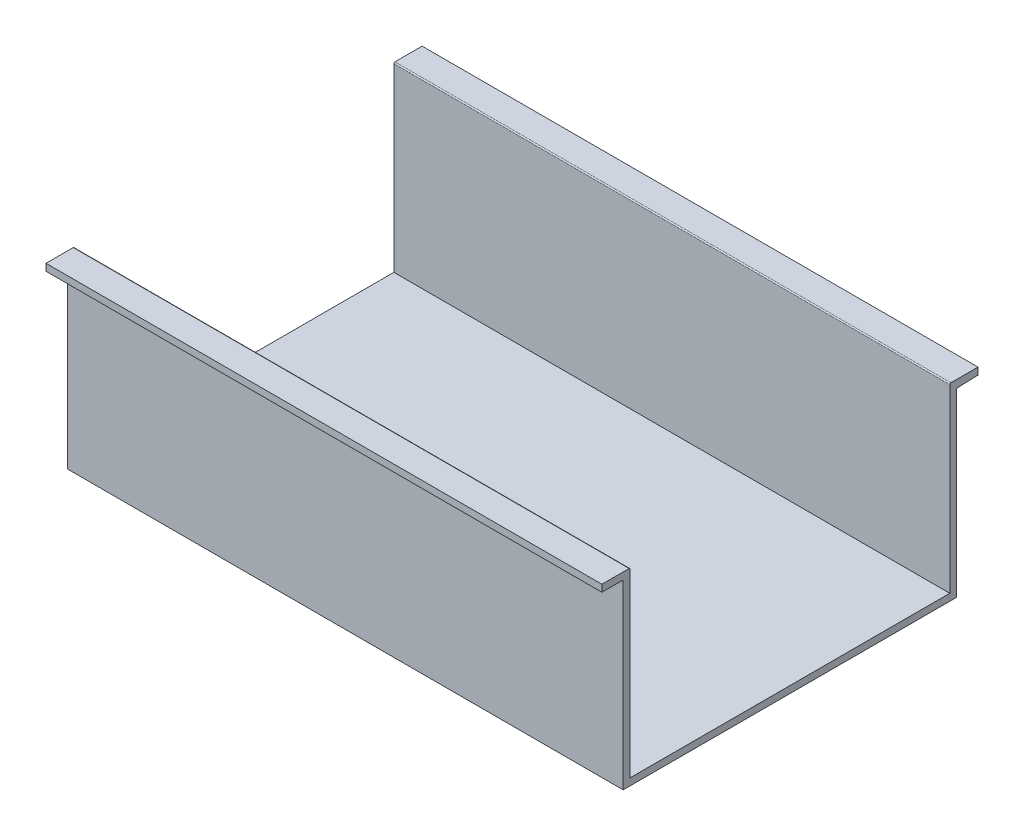
ISO-10303-21;
HEADER;
FILE_DESCRIPTION(('STEP AP214'),'2;1');
FILE_NAME('part.step','',(''),(''),'','','');
FILE_SCHEMA(('AUTOMOTIVE_DESIGN { 1 0 10303 214 1 1 1 1 }'));
ENDSEC;
DATA;
#1=APPLICATION_CONTEXT('core data for automotive mechanical design processes');
#2=APPLICATION_PROTOCOL_DEFINITION('international standard','automotive_design',2000,#1);
#3=PRODUCT_CONTEXT('',#1,'mechanical');
#4=PRODUCT('Part','Part','',(#3));
#5=PRODUCT_RELATED_PRODUCT_CATEGORY('part','',(#4));
#6=PRODUCT_DEFINITION_FORMATION('','',#4);
#7=PRODUCT_DEFINITION_CONTEXT('part definition',#1,'design');
#8=PRODUCT_DEFINITION('design','',#6,#7);
#9=PRODUCT_DEFINITION_SHAPE('','',#8);
#10=(LENGTH_UNIT() NAMED_UNIT(*) SI_UNIT(.MILLI.,.METRE.));
#11=(NAMED_UNIT(*) PLANE_ANGLE_UNIT() SI_UNIT($,.RADIAN.));
#12=(NAMED_UNIT(*) SI_UNIT($,.STERADIAN.) SOLID_ANGLE_UNIT());
#13=UNCERTAINTY_MEASURE_WITH_UNIT(LENGTH_MEASURE(1.E-05),#10,'distance_accuracy_value','');
#14=(GEOMETRIC_REPRESENTATION_CONTEXT(3) GLOBAL_UNCERTAINTY_ASSIGNED_CONTEXT((#13)) GLOBAL_UNIT_ASSIGNED_CONTEXT((#10,
#11,#12)) REPRESENTATION_CONTEXT('',''));
#15=CARTESIAN_POINT('',(0.,0.,0.));
#16=DIRECTION('',(0.,0.,1.));
#17=DIRECTION('',(1.,0.,0.));
#18=AXIS2_PLACEMENT_3D('',#15,#16,#17);
#19=CARTESIAN_POINT('',(400.,-0.8,-240.));
#20=DIRECTION('',(0.,0.,1.));
#21=DIRECTION('',(0.,-1.,0.));
#22=AXIS2_PLACEMENT_3D('',#19,#20,#21);
#23=PLANE('',#22);
#24=DIRECTION('',(0.,1.,0.));
#25=VECTOR('',#24,1.);
#26=CARTESIAN_POINT('',(0.,-0.8,-240.));
#27=LINE('',#26,#25);
#28=CARTESIAN_POINT('',(0.,-130.270799085378,-240.));
#29=VERTEX_POINT('',#28);
#30=CARTESIAN_POINT('',(0.,-0.8,-240.));
#31=VERTEX_POINT('',#30);
#32=EDGE_CURVE('E190',#29,#31,#27,.T.);
#33=ORIENTED_EDGE('',*,*,#32,.T.);
#34=DIRECTION('',(-1.,0.,0.));
#35=VECTOR('',#34,1.);
#36=CARTESIAN_POINT('',(400.,-0.8,-240.));
#37=LINE('',#36,#35);
#38=CARTESIAN_POINT('',(400.,-0.8,-240.));
#39=VERTEX_POINT('',#38);
#40=EDGE_CURVE('E11',#39,#31,#37,.T.);
#41=ORIENTED_EDGE('',*,*,#40,.F.);
#42=DIRECTION('',(0.,1.,0.));
#43=VECTOR('',#42,1.);
#44=CARTESIAN_POINT('',(400.,-0.8,-240.));
#45=LINE('',#44,#43);
#46=CARTESIAN_POINT('',(400.,-130.270799085378,-240.));
#47=VERTEX_POINT('',#46);
#48=EDGE_CURVE('E238',#47,#39,#45,.T.);
#49=ORIENTED_EDGE('',*,*,#48,.F.);
#50=DIRECTION('',(-1.,0.,0.));
#51=VECTOR('',#50,1.);
#52=CARTESIAN_POINT('',(400.,-130.270799085378,-240.));
#53=LINE('',#52,#51);
#54=EDGE_CURVE('E186',#47,#29,#53,.T.);
#55=ORIENTED_EDGE('',*,*,#54,.T.);
#56=EDGE_LOOP('',(#33,#41,#49,#55));
#57=FACE_BOUND('',#56,.T.);
#58=ADVANCED_FACE('F41',(#57),#23,.F.);
#59=CARTESIAN_POINT('',(400.,-0.8,-240.8));
#60=DIRECTION('',(-1.,0.,0.));
#61=DIRECTION('',(0.,0.,1.));
#62=AXIS2_PLACEMENT_3D('',#59,#60,#61);
#63=CYLINDRICAL_SURFACE('',#62,0.799999999999997);
#64=CARTESIAN_POINT('',(0.,-0.8,-240.8));
#65=DIRECTION('',(-1.,0.,0.));
#66=DIRECTION('',(0.,0.,-1.));
#67=AXIS2_PLACEMENT_3D('',#64,#65,#66);
#68=CIRCLE('',#67,0.799999999999997);
#69=CARTESIAN_POINT('',(0.,-0.000530043772431423,-240.770883182016));
#70=VERTEX_POINT('',#69);
#71=EDGE_CURVE('E194',#31,#70,#68,.T.);
#72=ORIENTED_EDGE('',*,*,#71,.T.);
#73=DIRECTION('',(-1.,0.,0.));
#74=VECTOR('',#73,1.);
#75=CARTESIAN_POINT('',(400.,-0.000530043772431423,-240.770883182016));
#76=LINE('',#75,#74);
#77=CARTESIAN_POINT('',(400.,-0.000530043772431423,-240.770883182016));
#78=VERTEX_POINT('',#77);
#79=EDGE_CURVE('E50',#78,#70,#76,.T.);
#80=ORIENTED_EDGE('',*,*,#79,.F.);
#81=CARTESIAN_POINT('',(400.,-0.8,-240.8));
#82=DIRECTION('',(-1.,0.,0.));
#83=DIRECTION('',(0.,0.,-1.));
#84=AXIS2_PLACEMENT_3D('',#81,#82,#83);
#85=CIRCLE('',#84,0.799999999999997);
#86=EDGE_CURVE('E125',#39,#78,#85,.T.);
#87=ORIENTED_EDGE('',*,*,#86,.F.);
#88=ORIENTED_EDGE('',*,*,#40,.T.);
#89=EDGE_LOOP('',(#72,#80,#87,#88));
#90=FACE_BOUND('',#89,.T.);
#91=ADVANCED_FACE('F360',(#90),#63,.F.);
#92=CARTESIAN_POINT('',(400.,-0.000530043772431423,-240.770883182016));
#93=DIRECTION('',(0.,0.99933744528446,0.0363960224795136));
#94=DIRECTION('',(0.,-0.0363960224795136,0.99933744528446));
#95=AXIS2_PLACEMENT_3D('',#92,#93,#94);
#96=PLANE('',#95);
#97=DIRECTION('',(0.,0.0363960224795136,-0.99933744528446));
#98=VECTOR('',#97,1.);
#99=CARTESIAN_POINT('',(0.,-0.000530043772431423,-240.770883182016));
#100=LINE('',#99,#98);
#101=CARTESIAN_POINT('',(0.,0.529200914621561,-255.315878667375));
#102=VERTEX_POINT('',#101);
#103=EDGE_CURVE('E197',#70,#102,#100,.T.);
#104=ORIENTED_EDGE('',*,*,#103,.T.);
#105=DIRECTION('',(-1.,0.,0.));
#106=VECTOR('',#105,1.);
#107=CARTESIAN_POINT('',(400.,0.529200914621561,-255.315878667375));
#108=LINE('',#107,#106);
#109=CARTESIAN_POINT('',(400.,0.529200914621561,-255.315878667375));
#110=VERTEX_POINT('',#109);
#111=EDGE_CURVE('E281',#110,#102,#108,.T.);
#112=ORIENTED_EDGE('',*,*,#111,.F.);
#113=DIRECTION('',(0.,0.0363960224795136,-0.99933744528446));
#114=VECTOR('',#113,1.);
#115=CARTESIAN_POINT('',(400.,-0.000530043772431423,-240.770883182016));
#116=LINE('',#115,#114);
#117=EDGE_CURVE('E291',#78,#110,#116,.T.);
#118=ORIENTED_EDGE('',*,*,#117,.F.);
#119=ORIENTED_EDGE('',*,*,#79,.T.);
#120=EDGE_LOOP('',(#104,#112,#118,#119));
#121=FACE_BOUND('',#120,.T.);
#122=ADVANCED_FACE('F289',(#121),#96,.F.);
#123=CARTESIAN_POINT('',(400.,0.529200914621561,-255.315878667375));
#124=DIRECTION('',(0.,0.,1.));
#125=DIRECTION('',(1.,0.,0.));
#126=AXIS2_PLACEMENT_3D('',#123,#124,#125);
#127=PLANE('',#126);
#128=DIRECTION('',(0.,1.,0.));
#129=VECTOR('',#128,1.);
#130=CARTESIAN_POINT('',(0.,0.529200914621561,-255.315878667375));
#131=LINE('',#130,#129);
#132=CARTESIAN_POINT('',(0.,5.52920091462156,-255.315878667375));
#133=VERTEX_POINT('',#132);
#134=EDGE_CURVE('E200',#102,#133,#131,.T.);
#135=ORIENTED_EDGE('',*,*,#134,.T.);
#136=DIRECTION('',(-1.,0.,0.));
#137=VECTOR('',#136,1.);
#138=CARTESIAN_POINT('',(400.,5.52920091462156,-255.315878667375));
#139=LINE('',#138,#137);
#140=CARTESIAN_POINT('',(400.,5.52920091462156,-255.315878667375));
#141=VERTEX_POINT('',#140);
#142=EDGE_CURVE('E277',#141,#133,#139,.T.);
#143=ORIENTED_EDGE('',*,*,#142,.F.);
#144=DIRECTION('',(0.,1.,0.));
#145=VECTOR('',#144,1.);
#146=CARTESIAN_POINT('',(400.,0.529200914621561,-255.315878667375));
#147=LINE('',#146,#145);
#148=EDGE_CURVE('E310',#110,#141,#147,.T.);
#149=ORIENTED_EDGE('',*,*,#148,.F.);
#150=ORIENTED_EDGE('',*,*,#111,.T.);
#151=EDGE_LOOP('',(#135,#143,#149,#150));
#152=FACE_BOUND('',#151,.T.);
#153=ADVANCED_FACE('F300',(#152),#127,.F.);
#154=CARTESIAN_POINT('',(400.,5.52920091462156,-255.315878667375));
#155=DIRECTION('',(0.,-1.,0.));
#156=DIRECTION('',(0.,0.,-1.));
#157=AXIS2_PLACEMENT_3D('',#154,#155,#156);
#158=PLANE('',#157);
#159=DIRECTION('',(0.,0.,1.));
#160=VECTOR('',#159,1.);
#161=CARTESIAN_POINT('',(0.,5.52920091462156,-255.315878667375));
#162=LINE('',#161,#160);
#163=CARTESIAN_POINT('',(0.,5.52920091462156,-235.8));
#164=VERTEX_POINT('',#163);
#165=EDGE_CURVE('E203',#133,#164,#162,.T.);
#166=ORIENTED_EDGE('',*,*,#165,.T.);
#167=DIRECTION('',(-1.,0.,0.));
#168=VECTOR('',#167,1.);
#169=CARTESIAN_POINT('',(400.,5.52920091462156,-235.8));
#170=LINE('',#169,#168);
#171=CARTESIAN_POINT('',(400.,5.52920091462156,-235.8));
#172=VERTEX_POINT('',#171);
#173=EDGE_CURVE('E273',#172,#164,#170,.T.);
#174=ORIENTED_EDGE('',*,*,#173,.F.);
#175=DIRECTION('',(0.,0.,1.));
#176=VECTOR('',#175,1.);
#177=CARTESIAN_POINT('',(400.,5.52920091462156,-255.315878667375));
#178=LINE('',#177,#176);
#179=EDGE_CURVE('E306',#141,#172,#178,.T.);
#180=ORIENTED_EDGE('',*,*,#179,.F.);
#181=ORIENTED_EDGE('',*,*,#142,.T.);
#182=EDGE_LOOP('',(#166,#174,#180,#181));
#183=FACE_BOUND('',#182,.T.);
#184=ADVANCED_FACE('F304',(#183),#158,.F.);
#185=CARTESIAN_POINT('',(400.,4.72920091462156,-235.8));
#186=DIRECTION('',(-1.,0.,0.));
#187=DIRECTION('',(0.,0.,1.));
#188=AXIS2_PLACEMENT_3D('',#185,#186,#187);
#189=CYLINDRICAL_SURFACE('',#188,0.8);
#190=CARTESIAN_POINT('',(0.,4.72920091462156,-235.8));
#191=DIRECTION('',(1.,0.,0.));
#192=DIRECTION('',(0.,0.,1.));
#193=AXIS2_PLACEMENT_3D('',#190,#191,#192);
#194=CIRCLE('',#193,0.8);
#195=CARTESIAN_POINT('',(0.,4.72920091462156,-235.));
#196=VERTEX_POINT('',#195);
#197=EDGE_CURVE('E206',#164,#196,#194,.T.);
#198=ORIENTED_EDGE('',*,*,#197,.T.);
#199=DIRECTION('',(-1.,0.,0.));
#200=VECTOR('',#199,1.);
#201=CARTESIAN_POINT('',(400.,4.72920091462156,-235.));
#202=LINE('',#201,#200);
#203=CARTESIAN_POINT('',(400.,4.72920091462156,-235.));
#204=VERTEX_POINT('',#203);
#205=EDGE_CURVE('E269',#204,#196,#202,.T.);
#206=ORIENTED_EDGE('',*,*,#205,.F.);
#207=CARTESIAN_POINT('',(400.,4.72920091462156,-235.8));
#208=DIRECTION('',(1.,0.,0.));
#209=DIRECTION('',(0.,0.,1.));
#210=AXIS2_PLACEMENT_3D('',#207,#208,#209);
#211=CIRCLE('',#210,0.8);
#212=EDGE_CURVE('E309',#172,#204,#211,.T.);
#213=ORIENTED_EDGE('',*,*,#212,.F.);
#214=ORIENTED_EDGE('',*,*,#173,.T.);
#215=EDGE_LOOP('',(#198,#206,#213,#214));
#216=FACE_BOUND('',#215,.T.);
#217=ADVANCED_FACE('F373',(#216),#189,.T.);
#218=CARTESIAN_POINT('',(400.,-5.,-235.));
#219=DIRECTION('',(0.,0.,-1.));
#220=DIRECTION('',(0.,1.,0.));
#221=AXIS2_PLACEMENT_3D('',#218,#219,#220);
#222=PLANE('',#221);
#223=DIRECTION('',(0.,-1.,0.));
#224=VECTOR('',#223,1.);
#225=CARTESIAN_POINT('',(0.,-5.,-235.));
#226=LINE('',#225,#224);
#227=CARTESIAN_POINT('',(0.,-125.270799085378,-235.));
#228=VERTEX_POINT('',#227);
#229=EDGE_CURVE('E210',#196,#228,#226,.T.);
#230=ORIENTED_EDGE('',*,*,#229,.T.);
#231=DIRECTION('',(-1.,0.,0.));
#232=VECTOR('',#231,1.);
#233=CARTESIAN_POINT('',(400.,-125.270799085378,-235.));
#234=LINE('',#233,#232);
#235=CARTESIAN_POINT('',(400.,-125.270799085378,-235.));
#236=VERTEX_POINT('',#235);
#237=EDGE_CURVE('E265',#236,#228,#234,.T.);
#238=ORIENTED_EDGE('',*,*,#237,.F.);
#239=DIRECTION('',(0.,-1.,0.));
#240=VECTOR('',#239,1.);
#241=CARTESIAN_POINT('',(400.,4.72920091462156,-235.));
#242=LINE('',#241,#240);
#243=EDGE_CURVE('E314',#204,#236,#242,.T.);
#244=ORIENTED_EDGE('',*,*,#243,.F.);
#245=ORIENTED_EDGE('',*,*,#205,.T.);
#246=EDGE_LOOP('',(#230,#238,#244,#245));
#247=FACE_BOUND('',#246,.T.);
#248=ADVANCED_FACE('F376',(#247),#222,.F.);
#249=CARTESIAN_POINT('',(400.,-125.270799085378,-5.00000000000002));
#250=DIRECTION('',(0.,-1.,0.));
#251=DIRECTION('',(0.,0.,-1.));
#252=AXIS2_PLACEMENT_3D('',#249,#250,#251);
#253=PLANE('',#252);
#254=DIRECTION('',(0.,0.,1.));
#255=VECTOR('',#254,1.);
#256=CARTESIAN_POINT('',(0.,-125.270799085378,-5.00000000000002));
#257=LINE('',#256,#255);
#258=CARTESIAN_POINT('',(0.,-125.270799085378,-5.00000000000002));
#259=VERTEX_POINT('',#258);
#260=EDGE_CURVE('E213',#228,#259,#257,.T.);
#261=ORIENTED_EDGE('',*,*,#260,.T.);
#262=DIRECTION('',(-1.,0.,0.));
#263=VECTOR('',#262,1.);
#264=CARTESIAN_POINT('',(400.,-125.270799085378,-5.00000000000002));
#265=LINE('',#264,#263);
#266=CARTESIAN_POINT('',(400.,-125.270799085378,-5.00000000000002));
#267=VERTEX_POINT('',#266);
#268=EDGE_CURVE('E261',#267,#259,#265,.T.);
#269=ORIENTED_EDGE('',*,*,#268,.F.);
#270=DIRECTION('',(0.,0.,1.));
#271=VECTOR('',#270,1.);
#272=CARTESIAN_POINT('',(400.,-125.270799085378,-5.00000000000002));
#273=LINE('',#272,#271);
#274=EDGE_CURVE('E321',#236,#267,#273,.T.);
#275=ORIENTED_EDGE('',*,*,#274,.F.);
#276=ORIENTED_EDGE('',*,*,#237,.T.);
#277=EDGE_LOOP('',(#261,#269,#275,#276));
#278=FACE_BOUND('',#277,.T.);
#279=ADVANCED_FACE('F380',(#278),#253,.F.);
#280=CARTESIAN_POINT('',(400.,4.72920091462156,-5.));
#281=DIRECTION('',(0.,0.,1.));
#282=DIRECTION('',(0.,-1.,0.));
#283=AXIS2_PLACEMENT_3D('',#280,#281,#282);
#284=PLANE('',#283);
#285=DIRECTION('',(0.,1.,0.));
#286=VECTOR('',#285,1.);
#287=CARTESIAN_POINT('',(0.,4.72920091462156,-5.));
#288=LINE('',#287,#286);
#289=CARTESIAN_POINT('',(0.,4.72920091462156,-5.00000000000001));
#290=VERTEX_POINT('',#289);
#291=EDGE_CURVE('E217',#259,#290,#288,.T.);
#292=ORIENTED_EDGE('',*,*,#291,.T.);
#293=DIRECTION('',(-1.,0.,0.));
#294=VECTOR('',#293,1.);
#295=CARTESIAN_POINT('',(400.,4.72920091462156,-5.00000000000001));
#296=LINE('',#295,#294);
#297=CARTESIAN_POINT('',(400.,4.72920091462156,-5.00000000000001));
#298=VERTEX_POINT('',#297);
#299=EDGE_CURVE('E257',#298,#290,#296,.T.);
#300=ORIENTED_EDGE('',*,*,#299,.F.);
#301=DIRECTION('',(0.,1.,0.));
#302=VECTOR('',#301,1.);
#303=CARTESIAN_POINT('',(400.,-5.00000000000001,-5.));
#304=LINE('',#303,#302);
#305=EDGE_CURVE('E324',#267,#298,#304,.T.);
#306=ORIENTED_EDGE('',*,*,#305,.F.);
#307=ORIENTED_EDGE('',*,*,#268,.T.);
#308=EDGE_LOOP('',(#292,#300,#306,#307));
#309=FACE_BOUND('',#308,.T.);
#310=ADVANCED_FACE('F384',(#309),#284,.F.);
#311=CARTESIAN_POINT('',(400.,4.72920091462156,-4.20000000000001));
#312=DIRECTION('',(-1.,0.,0.));
#313=DIRECTION('',(0.,0.,1.));
#314=AXIS2_PLACEMENT_3D('',#311,#312,#313);
#315=CYLINDRICAL_SURFACE('',#314,0.799999999999999);
#316=CARTESIAN_POINT('',(0.,4.72920091462156,-4.20000000000001));
#317=DIRECTION('',(1.,0.,0.));
#318=DIRECTION('',(0.,0.,1.));
#319=AXIS2_PLACEMENT_3D('',#316,#317,#318);
#320=CIRCLE('',#319,0.799999999999999);
#321=CARTESIAN_POINT('',(0.,5.52920091462156,-4.2));
#322=VERTEX_POINT('',#321);
#323=EDGE_CURVE('E220',#290,#322,#320,.T.);
#324=ORIENTED_EDGE('',*,*,#323,.T.);
#325=DIRECTION('',(-1.,0.,0.));
#326=VECTOR('',#325,1.);
#327=CARTESIAN_POINT('',(400.,5.52920091462156,-4.2));
#328=LINE('',#327,#326);
#329=CARTESIAN_POINT('',(400.,5.52920091462156,-4.2));
#330=VERTEX_POINT('',#329);
#331=EDGE_CURVE('E253',#330,#322,#328,.T.);
#332=ORIENTED_EDGE('',*,*,#331,.F.);
#333=CARTESIAN_POINT('',(400.,4.72920091462156,-4.20000000000001));
#334=DIRECTION('',(1.,0.,0.));
#335=DIRECTION('',(0.,0.,1.));
#336=AXIS2_PLACEMENT_3D('',#333,#334,#335);
#337=CIRCLE('',#336,0.799999999999999);
#338=EDGE_CURVE('E327',#298,#330,#337,.T.);
#339=ORIENTED_EDGE('',*,*,#338,.F.);
#340=ORIENTED_EDGE('',*,*,#299,.T.);
#341=EDGE_LOOP('',(#324,#332,#339,#340));
#342=FACE_BOUND('',#341,.T.);
#343=ADVANCED_FACE('F388',(#342),#315,.T.);
#344=CARTESIAN_POINT('',(400.,5.52920091462156,15.3158786673751));
#345=DIRECTION('',(0.,-1.,0.));
#346=DIRECTION('',(0.,0.,-1.));
#347=AXIS2_PLACEMENT_3D('',#344,#345,#346);
#348=PLANE('',#347);
#349=DIRECTION('',(0.,0.,1.));
#350=VECTOR('',#349,1.);
#351=CARTESIAN_POINT('',(0.,5.52920091462156,15.3158786673751));
#352=LINE('',#351,#350);
#353=CARTESIAN_POINT('',(0.,5.52920091462156,15.3158786673751));
#354=VERTEX_POINT('',#353);
#355=EDGE_CURVE('E223',#322,#354,#352,.T.);
#356=ORIENTED_EDGE('',*,*,#355,.T.);
#357=DIRECTION('',(-1.,0.,0.));
#358=VECTOR('',#357,1.);
#359=CARTESIAN_POINT('',(400.,5.52920091462156,15.3158786673751));
#360=LINE('',#359,#358);
#361=CARTESIAN_POINT('',(400.,5.52920091462156,15.3158786673751));
#362=VERTEX_POINT('',#361);
#363=EDGE_CURVE('E249',#362,#354,#360,.T.);
#364=ORIENTED_EDGE('',*,*,#363,.F.);
#365=DIRECTION('',(0.,0.,1.));
#366=VECTOR('',#365,1.);
#367=CARTESIAN_POINT('',(400.,5.52920091462156,15.3158786673751));
#368=LINE('',#367,#366);
#369=EDGE_CURVE('E330',#330,#362,#368,.T.);
#370=ORIENTED_EDGE('',*,*,#369,.F.);
#371=ORIENTED_EDGE('',*,*,#331,.T.);
#372=EDGE_LOOP('',(#356,#364,#370,#371));
#373=FACE_BOUND('',#372,.T.);
#374=ADVANCED_FACE('F392',(#373),#348,.F.);
#375=CARTESIAN_POINT('',(400.,0.529200914621561,15.3158786673751));
#376=DIRECTION('',(0.,0.,-1.));
#377=DIRECTION('',(-1.,0.,0.));
#378=AXIS2_PLACEMENT_3D('',#375,#376,#377);
#379=PLANE('',#378);
#380=DIRECTION('',(0.,-1.,0.));
#381=VECTOR('',#380,1.);
#382=CARTESIAN_POINT('',(0.,0.529200914621561,15.3158786673751));
#383=LINE('',#382,#381);
#384=CARTESIAN_POINT('',(0.,0.529200914621561,15.3158786673751));
#385=VERTEX_POINT('',#384);
#386=EDGE_CURVE('E226',#354,#385,#383,.T.);
#387=ORIENTED_EDGE('',*,*,#386,.T.);
#388=DIRECTION('',(-1.,0.,0.));
#389=VECTOR('',#388,1.);
#390=CARTESIAN_POINT('',(400.,0.529200914621561,15.3158786673751));
#391=LINE('',#390,#389);
#392=CARTESIAN_POINT('',(400.,0.529200914621561,15.3158786673751));
#393=VERTEX_POINT('',#392);
#394=EDGE_CURVE('E245',#393,#385,#391,.T.);
#395=ORIENTED_EDGE('',*,*,#394,.F.);
#396=DIRECTION('',(0.,-1.,0.));
#397=VECTOR('',#396,1.);
#398=CARTESIAN_POINT('',(400.,0.529200914621561,15.3158786673751));
#399=LINE('',#398,#397);
#400=EDGE_CURVE('E333',#362,#393,#399,.T.);
#401=ORIENTED_EDGE('',*,*,#400,.F.);
#402=ORIENTED_EDGE('',*,*,#363,.T.);
#403=EDGE_LOOP('',(#387,#395,#401,#402));
#404=FACE_BOUND('',#403,.T.);
#405=ADVANCED_FACE('F341',(#404),#379,.F.);
#406=CARTESIAN_POINT('',(400.,0.529200914621562,0.8));
#407=DIRECTION('',(0.,1.,0.));
#408=DIRECTION('',(0.,0.,1.));
#409=AXIS2_PLACEMENT_3D('',#406,#407,#408);
#410=PLANE('',#409);
#411=DIRECTION('',(0.,0.,-1.));
#412=VECTOR('',#411,1.);
#413=CARTESIAN_POINT('',(0.,0.529200914621562,0.8));
#414=LINE('',#413,#412);
#415=CARTESIAN_POINT('',(0.,0.529200914621562,0.8));
#416=VERTEX_POINT('',#415);
#417=EDGE_CURVE('E229',#385,#416,#414,.T.);
#418=ORIENTED_EDGE('',*,*,#417,.T.);
#419=DIRECTION('',(-1.,0.,0.));
#420=VECTOR('',#419,1.);
#421=CARTESIAN_POINT('',(400.,0.529200914621562,0.8));
#422=LINE('',#421,#420);
#423=CARTESIAN_POINT('',(400.,0.529200914621562,0.8));
#424=VERTEX_POINT('',#423);
#425=EDGE_CURVE('E179',#424,#416,#422,.T.);
#426=ORIENTED_EDGE('',*,*,#425,.F.);
#427=DIRECTION('',(0.,0.,-1.));
#428=VECTOR('',#427,1.);
#429=CARTESIAN_POINT('',(400.,0.529200914621562,0.8));
#430=LINE('',#429,#428);
#431=EDGE_CURVE('E168',#393,#424,#430,.T.);
#432=ORIENTED_EDGE('',*,*,#431,.F.);
#433=ORIENTED_EDGE('',*,*,#394,.T.);
#434=EDGE_LOOP('',(#418,#426,#432,#433));
#435=FACE_BOUND('',#434,.T.);
#436=ADVANCED_FACE('F345',(#435),#410,.F.);
#437=CARTESIAN_POINT('',(400.,-0.270799085378438,0.8));
#438=DIRECTION('',(-1.,0.,0.));
#439=DIRECTION('',(0.,0.,1.));
#440=AXIS2_PLACEMENT_3D('',#437,#438,#439);
#441=CYLINDRICAL_SURFACE('',#440,0.8);
#442=CARTESIAN_POINT('',(0.,-0.270799085378438,0.8));
#443=DIRECTION('',(-1.,0.,0.));
#444=DIRECTION('',(0.,0.,1.));
#445=AXIS2_PLACEMENT_3D('',#442,#443,#444);
#446=CIRCLE('',#445,0.8);
#447=CARTESIAN_POINT('',(0.,-0.270799085378437,0.));
#448=VERTEX_POINT('',#447);
#449=EDGE_CURVE('E177',#416,#448,#446,.T.);
#450=ORIENTED_EDGE('',*,*,#449,.T.);
#451=DIRECTION('',(-1.,0.,0.));
#452=VECTOR('',#451,1.);
#453=CARTESIAN_POINT('',(400.,-0.270799085378437,0.));
#454=LINE('',#453,#452);
#455=CARTESIAN_POINT('',(400.,-0.270799085378437,0.));
#456=VERTEX_POINT('',#455);
#457=EDGE_CURVE('E174',#456,#448,#454,.T.);
#458=ORIENTED_EDGE('',*,*,#457,.F.);
#459=CARTESIAN_POINT('',(400.,-0.270799085378438,0.8));
#460=DIRECTION('',(-1.,0.,0.));
#461=DIRECTION('',(0.,0.,1.));
#462=AXIS2_PLACEMENT_3D('',#459,#460,#461);
#463=CIRCLE('',#462,0.8);
#464=EDGE_CURVE('E162',#424,#456,#463,.T.);
#465=ORIENTED_EDGE('',*,*,#464,.F.);
#466=ORIENTED_EDGE('',*,*,#425,.T.);
#467=EDGE_LOOP('',(#450,#458,#465,#466));
#468=FACE_BOUND('',#467,.T.);
#469=ADVANCED_FACE('F175',(#468),#441,.F.);
#470=CARTESIAN_POINT('',(400.,-0.270799085378437,0.));
#471=DIRECTION('',(0.,0.,-1.));
#472=DIRECTION('',(0.,1.,0.));
#473=AXIS2_PLACEMENT_3D('',#470,#471,#472);
#474=PLANE('',#473);
#475=DIRECTION('',(0.,-1.,0.));
#476=VECTOR('',#475,1.);
#477=CARTESIAN_POINT('',(0.,-0.270799085378437,0.));
#478=LINE('',#477,#476);
#479=CARTESIAN_POINT('',(0.,-130.270799085378,0.));
#480=VERTEX_POINT('',#479);
#481=EDGE_CURVE('E111',#448,#480,#478,.T.);
#482=ORIENTED_EDGE('',*,*,#481,.T.);
#483=DIRECTION('',(-1.,0.,0.));
#484=VECTOR('',#483,1.);
#485=CARTESIAN_POINT('',(400.,-130.270799085378,0.));
#486=LINE('',#485,#484);
#487=CARTESIAN_POINT('',(400.,-130.270799085378,0.));
#488=VERTEX_POINT('',#487);
#489=EDGE_CURVE('E180',#488,#480,#486,.T.);
#490=ORIENTED_EDGE('',*,*,#489,.F.);
#491=DIRECTION('',(0.,-1.,0.));
#492=VECTOR('',#491,1.);
#493=CARTESIAN_POINT('',(400.,-0.270799085378437,0.));
#494=LINE('',#493,#492);
#495=EDGE_CURVE('E166',#456,#488,#494,.T.);
#496=ORIENTED_EDGE('',*,*,#495,.F.);
#497=ORIENTED_EDGE('',*,*,#457,.T.);
#498=EDGE_LOOP('',(#482,#490,#496,#497));
#499=FACE_BOUND('',#498,.T.);
#500=ADVANCED_FACE('F182',(#499),#474,.F.);
#501=CARTESIAN_POINT('',(400.,-130.270799085378,0.));
#502=DIRECTION('',(0.,1.,0.));
#503=DIRECTION('',(0.,0.,1.));
#504=AXIS2_PLACEMENT_3D('',#501,#502,#503);
#505=PLANE('',#504);
#506=DIRECTION('',(0.,0.,-1.));
#507=VECTOR('',#506,1.);
#508=CARTESIAN_POINT('',(0.,-130.270799085378,0.));
#509=LINE('',#508,#507);
#510=EDGE_CURVE('E117',#480,#29,#509,.T.);
#511=ORIENTED_EDGE('',*,*,#510,.T.);
#512=ORIENTED_EDGE('',*,*,#54,.F.);
#513=DIRECTION('',(0.,0.,-1.));
#514=VECTOR('',#513,1.);
#515=CARTESIAN_POINT('',(400.,-130.270799085378,0.));
#516=LINE('',#515,#514);
#517=EDGE_CURVE('E58',#488,#47,#516,.T.);
#518=ORIENTED_EDGE('',*,*,#517,.F.);
#519=ORIENTED_EDGE('',*,*,#489,.T.);
#520=EDGE_LOOP('',(#511,#512,#518,#519));
#521=FACE_BOUND('',#520,.T.);
#522=ADVANCED_FACE('F349',(#521),#505,.F.);
#523=CARTESIAN_POINT('',(400.,-0.270799085378438,0.8));
#524=DIRECTION('',(-1.,0.,0.));
#525=DIRECTION('',(0.,0.,1.));
#526=AXIS2_PLACEMENT_3D('',#523,#524,#525);
#527=PLANE('',#526);
#528=ORIENTED_EDGE('',*,*,#48,.T.);
#529=ORIENTED_EDGE('',*,*,#86,.T.);
#530=ORIENTED_EDGE('',*,*,#117,.T.);
#531=ORIENTED_EDGE('',*,*,#148,.T.);
#532=ORIENTED_EDGE('',*,*,#179,.T.);
#533=ORIENTED_EDGE('',*,*,#212,.T.);
#534=ORIENTED_EDGE('',*,*,#243,.T.);
#535=ORIENTED_EDGE('',*,*,#274,.T.);
#536=ORIENTED_EDGE('',*,*,#305,.T.);
#537=ORIENTED_EDGE('',*,*,#338,.T.);
#538=ORIENTED_EDGE('',*,*,#369,.T.);
#539=ORIENTED_EDGE('',*,*,#400,.T.);
#540=ORIENTED_EDGE('',*,*,#431,.T.);
#541=ORIENTED_EDGE('',*,*,#464,.T.);
#542=ORIENTED_EDGE('',*,*,#495,.T.);
#543=ORIENTED_EDGE('',*,*,#517,.T.);
#544=EDGE_LOOP('',(#528,#529,#530,#531,#532,#533,#534,#535,#536,#537,#538,#539,#540,#541,#542,#543));
#545=FACE_BOUND('',#544,.T.);
#546=ADVANCED_FACE('F164',(#545),#527,.F.);
#547=CARTESIAN_POINT('',(0.,-0.270799085378438,0.8));
#548=DIRECTION('',(-1.,0.,0.));
#549=DIRECTION('',(0.,0.,1.));
#550=AXIS2_PLACEMENT_3D('',#547,#548,#549);
#551=PLANE('',#550);
#552=ORIENTED_EDGE('',*,*,#32,.F.);
#553=ORIENTED_EDGE('',*,*,#510,.F.);
#554=ORIENTED_EDGE('',*,*,#481,.F.);
#555=ORIENTED_EDGE('',*,*,#449,.F.);
#556=ORIENTED_EDGE('',*,*,#417,.F.);
#557=ORIENTED_EDGE('',*,*,#386,.F.);
#558=ORIENTED_EDGE('',*,*,#355,.F.);
#559=ORIENTED_EDGE('',*,*,#323,.F.);
#560=ORIENTED_EDGE('',*,*,#291,.F.);
#561=ORIENTED_EDGE('',*,*,#260,.F.);
#562=ORIENTED_EDGE('',*,*,#229,.F.);
#563=ORIENTED_EDGE('',*,*,#197,.F.);
#564=ORIENTED_EDGE('',*,*,#165,.F.);
#565=ORIENTED_EDGE('',*,*,#134,.F.);
#566=ORIENTED_EDGE('',*,*,#103,.F.);
#567=ORIENTED_EDGE('',*,*,#71,.F.);
#568=EDGE_LOOP('',(#552,#553,#554,#555,#556,#557,#558,#559,#560,#561,#562,#563,#564,#565,#566,#567));
#569=FACE_BOUND('',#568,.T.);
#570=ADVANCED_FACE('F295',(#569),#551,.T.);
#571=CLOSED_SHELL('',(#58,#91,#122,#153,#184,#217,#248,#279,#310,#343,#374,#405,#436,#469,#500,
#522,#546,#570));
#572=MANIFOLD_SOLID_BREP('B2',#571);
#573=ADVANCED_BREP_SHAPE_REPRESENTATION('',(#18,#572),#14);
#574=SHAPE_DEFINITION_REPRESENTATION(#9,#573);
ENDSEC;
END-ISO-10303-21;
